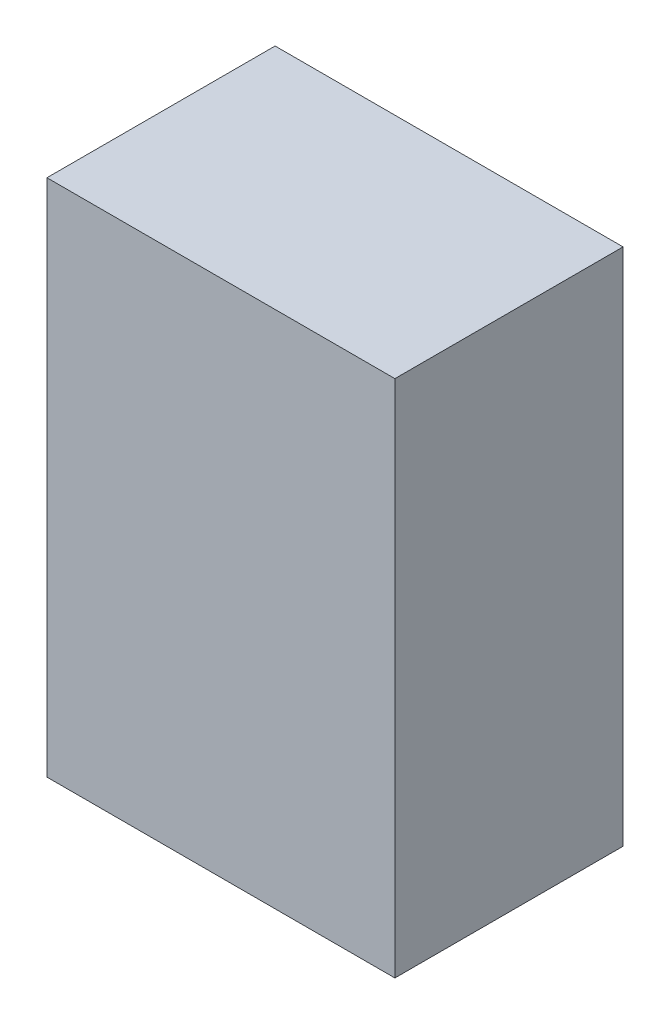
ISO-10303-21;
HEADER;
FILE_DESCRIPTION(('STEP AP214'),'2;1');
FILE_NAME('part.step','',(''),(''),'','','');
FILE_SCHEMA(('AUTOMOTIVE_DESIGN { 1 0 10303 214 1 1 1 1 }'));
ENDSEC;
DATA;
#1=APPLICATION_CONTEXT('core data for automotive mechanical design processes');
#2=APPLICATION_PROTOCOL_DEFINITION('international standard','automotive_design',2000,#1);
#3=PRODUCT_CONTEXT('',#1,'mechanical');
#4=PRODUCT('Part','Part','',(#3));
#5=PRODUCT_RELATED_PRODUCT_CATEGORY('part','',(#4));
#6=PRODUCT_DEFINITION_FORMATION('','',#4);
#7=PRODUCT_DEFINITION_CONTEXT('part definition',#1,'design');
#8=PRODUCT_DEFINITION('design','',#6,#7);
#9=PRODUCT_DEFINITION_SHAPE('','',#8);
#10=(LENGTH_UNIT() NAMED_UNIT(*) SI_UNIT(.MILLI.,.METRE.));
#11=(NAMED_UNIT(*) PLANE_ANGLE_UNIT() SI_UNIT($,.RADIAN.));
#12=(NAMED_UNIT(*) SI_UNIT($,.STERADIAN.) SOLID_ANGLE_UNIT());
#13=UNCERTAINTY_MEASURE_WITH_UNIT(LENGTH_MEASURE(1.E-05),#10,'distance_accuracy_value','');
#14=(GEOMETRIC_REPRESENTATION_CONTEXT(3) GLOBAL_UNCERTAINTY_ASSIGNED_CONTEXT((#13)) GLOBAL_UNIT_ASSIGNED_CONTEXT((#10,
#11,#12)) REPRESENTATION_CONTEXT('',''));
#15=CARTESIAN_POINT('',(0.,0.,0.));
#16=DIRECTION('',(0.,0.,1.));
#17=DIRECTION('',(1.,0.,0.));
#18=AXIS2_PLACEMENT_3D('',#15,#16,#17);
#19=CARTESIAN_POINT('',(-0.30499812,0.45499782,0.3999992));
#20=DIRECTION('',(0.,0.,1.));
#21=DIRECTION('',(1.,0.,0.));
#22=AXIS2_PLACEMENT_3D('',#19,#20,#21);
#23=PLANE('',#22);
#24=DIRECTION('',(0.,1.,0.));
#25=VECTOR('',#24,1.);
#26=CARTESIAN_POINT('',(-0.30499812,-0.45499782,0.3999992));
#27=LINE('',#26,#25);
#28=CARTESIAN_POINT('',(-0.30499812,-0.45499782,0.3999992));
#29=VERTEX_POINT('',#28);
#30=CARTESIAN_POINT('',(-0.30499812,0.45499782,0.3999992));
#31=VERTEX_POINT('',#30);
#32=EDGE_CURVE('E26',#29,#31,#27,.T.);
#33=ORIENTED_EDGE('',*,*,#32,.F.);
#34=DIRECTION('',(-1.,0.,0.));
#35=VECTOR('',#34,1.);
#36=CARTESIAN_POINT('',(0.30499812,-0.45499782,0.3999992));
#37=LINE('',#36,#35);
#38=CARTESIAN_POINT('',(0.30499812,-0.45499782,0.3999992));
#39=VERTEX_POINT('',#38);
#40=EDGE_CURVE('E103',#39,#29,#37,.T.);
#41=ORIENTED_EDGE('',*,*,#40,.F.);
#42=DIRECTION('',(0.,-1.,0.));
#43=VECTOR('',#42,1.);
#44=CARTESIAN_POINT('',(0.30499812,0.45499782,0.3999992));
#45=LINE('',#44,#43);
#46=CARTESIAN_POINT('',(0.30499812,0.45499782,0.3999992));
#47=VERTEX_POINT('',#46);
#48=EDGE_CURVE('E79',#47,#39,#45,.T.);
#49=ORIENTED_EDGE('',*,*,#48,.F.);
#50=DIRECTION('',(1.,0.,0.));
#51=VECTOR('',#50,1.);
#52=CARTESIAN_POINT('',(-0.30499812,0.45499782,0.3999992));
#53=LINE('',#52,#51);
#54=EDGE_CURVE('E84',#31,#47,#53,.T.);
#55=ORIENTED_EDGE('',*,*,#54,.F.);
#56=EDGE_LOOP('',(#33,#41,#49,#55));
#57=FACE_BOUND('',#56,.T.);
#58=ADVANCED_FACE('F17',(#57),#23,.T.);
#59=CARTESIAN_POINT('',(-0.30499812,0.45499782,0.));
#60=DIRECTION('',(0.,0.,1.));
#61=DIRECTION('',(1.,0.,0.));
#62=AXIS2_PLACEMENT_3D('',#59,#60,#61);
#63=PLANE('',#62);
#64=DIRECTION('',(1.,0.,0.));
#65=VECTOR('',#64,1.);
#66=CARTESIAN_POINT('',(-0.30499812,0.45499782,0.));
#67=LINE('',#66,#65);
#68=CARTESIAN_POINT('',(-0.30499812,0.45499782,0.));
#69=VERTEX_POINT('',#68);
#70=CARTESIAN_POINT('',(0.30499812,0.45499782,0.));
#71=VERTEX_POINT('',#70);
#72=EDGE_CURVE('E67',#69,#71,#67,.T.);
#73=ORIENTED_EDGE('',*,*,#72,.T.);
#74=DIRECTION('',(0.,-1.,0.));
#75=VECTOR('',#74,1.);
#76=CARTESIAN_POINT('',(0.30499812,0.45499782,0.));
#77=LINE('',#76,#75);
#78=CARTESIAN_POINT('',(0.30499812,-0.45499782,0.));
#79=VERTEX_POINT('',#78);
#80=EDGE_CURVE('E107',#71,#79,#77,.T.);
#81=ORIENTED_EDGE('',*,*,#80,.T.);
#82=DIRECTION('',(-1.,0.,0.));
#83=VECTOR('',#82,1.);
#84=CARTESIAN_POINT('',(0.30499812,-0.45499782,0.));
#85=LINE('',#84,#83);
#86=CARTESIAN_POINT('',(-0.30499812,-0.45499782,0.));
#87=VERTEX_POINT('',#86);
#88=EDGE_CURVE('E69',#79,#87,#85,.T.);
#89=ORIENTED_EDGE('',*,*,#88,.T.);
#90=DIRECTION('',(0.,1.,0.));
#91=VECTOR('',#90,1.);
#92=CARTESIAN_POINT('',(-0.30499812,-0.45499782,0.));
#93=LINE('',#92,#91);
#94=EDGE_CURVE('E11',#87,#69,#93,.T.);
#95=ORIENTED_EDGE('',*,*,#94,.T.);
#96=EDGE_LOOP('',(#73,#81,#89,#95));
#97=FACE_BOUND('',#96,.T.);
#98=ADVANCED_FACE('F65',(#97),#63,.F.);
#99=CARTESIAN_POINT('',(-0.30499812,-0.45499782,0.));
#100=DIRECTION('',(-1.,0.,0.));
#101=DIRECTION('',(0.,0.,1.));
#102=AXIS2_PLACEMENT_3D('',#99,#100,#101);
#103=PLANE('',#102);
#104=DIRECTION('',(0.,0.,1.));
#105=VECTOR('',#104,1.);
#106=CARTESIAN_POINT('',(-0.30499812,-0.45499782,0.));
#107=LINE('',#106,#105);
#108=EDGE_CURVE('E100',#87,#29,#107,.T.);
#109=ORIENTED_EDGE('',*,*,#108,.T.);
#110=ORIENTED_EDGE('',*,*,#32,.T.);
#111=DIRECTION('',(0.,0.,1.));
#112=VECTOR('',#111,1.);
#113=CARTESIAN_POINT('',(-0.30499812,0.45499782,0.));
#114=LINE('',#113,#112);
#115=EDGE_CURVE('E75',#69,#31,#114,.T.);
#116=ORIENTED_EDGE('',*,*,#115,.F.);
#117=ORIENTED_EDGE('',*,*,#94,.F.);
#118=EDGE_LOOP('',(#109,#110,#116,#117));
#119=FACE_BOUND('',#118,.T.);
#120=ADVANCED_FACE('F81',(#119),#103,.T.);
#121=CARTESIAN_POINT('',(0.30499812,-0.45499782,0.));
#122=DIRECTION('',(0.,-1.,0.));
#123=DIRECTION('',(0.,0.,-1.));
#124=AXIS2_PLACEMENT_3D('',#121,#122,#123);
#125=PLANE('',#124);
#126=DIRECTION('',(0.,0.,1.));
#127=VECTOR('',#126,1.);
#128=CARTESIAN_POINT('',(0.30499812,-0.45499782,0.));
#129=LINE('',#128,#127);
#130=EDGE_CURVE('E92',#79,#39,#129,.T.);
#131=ORIENTED_EDGE('',*,*,#130,.T.);
#132=ORIENTED_EDGE('',*,*,#40,.T.);
#133=ORIENTED_EDGE('',*,*,#108,.F.);
#134=ORIENTED_EDGE('',*,*,#88,.F.);
#135=EDGE_LOOP('',(#131,#132,#133,#134));
#136=FACE_BOUND('',#135,.T.);
#137=ADVANCED_FACE('F115',(#136),#125,.T.);
#138=CARTESIAN_POINT('',(0.30499812,0.45499782,0.));
#139=DIRECTION('',(1.,0.,0.));
#140=DIRECTION('',(0.,1.,0.));
#141=AXIS2_PLACEMENT_3D('',#138,#139,#140);
#142=PLANE('',#141);
#143=DIRECTION('',(0.,0.,1.));
#144=VECTOR('',#143,1.);
#145=CARTESIAN_POINT('',(0.30499812,0.45499782,0.));
#146=LINE('',#145,#144);
#147=EDGE_CURVE('E77',#71,#47,#146,.T.);
#148=ORIENTED_EDGE('',*,*,#147,.T.);
#149=ORIENTED_EDGE('',*,*,#48,.T.);
#150=ORIENTED_EDGE('',*,*,#130,.F.);
#151=ORIENTED_EDGE('',*,*,#80,.F.);
#152=EDGE_LOOP('',(#148,#149,#150,#151));
#153=FACE_BOUND('',#152,.T.);
#154=ADVANCED_FACE('F119',(#153),#142,.T.);
#155=CARTESIAN_POINT('',(-0.30499812,0.45499782,0.));
#156=DIRECTION('',(0.,1.,0.));
#157=DIRECTION('',(1.,0.,0.));
#158=AXIS2_PLACEMENT_3D('',#155,#156,#157);
#159=PLANE('',#158);
#160=ORIENTED_EDGE('',*,*,#115,.T.);
#161=ORIENTED_EDGE('',*,*,#54,.T.);
#162=ORIENTED_EDGE('',*,*,#147,.F.);
#163=ORIENTED_EDGE('',*,*,#72,.F.);
#164=EDGE_LOOP('',(#160,#161,#162,#163));
#165=FACE_BOUND('',#164,.T.);
#166=ADVANCED_FACE('F73',(#165),#159,.T.);
#167=CLOSED_SHELL('',(#58,#98,#120,#137,#154,#166));
#168=MANIFOLD_SOLID_BREP('B1',#167);
#169=ADVANCED_BREP_SHAPE_REPRESENTATION('',(#18,#168),#14);
#170=SHAPE_DEFINITION_REPRESENTATION(#9,#169);
ENDSEC;
END-ISO-10303-21;
